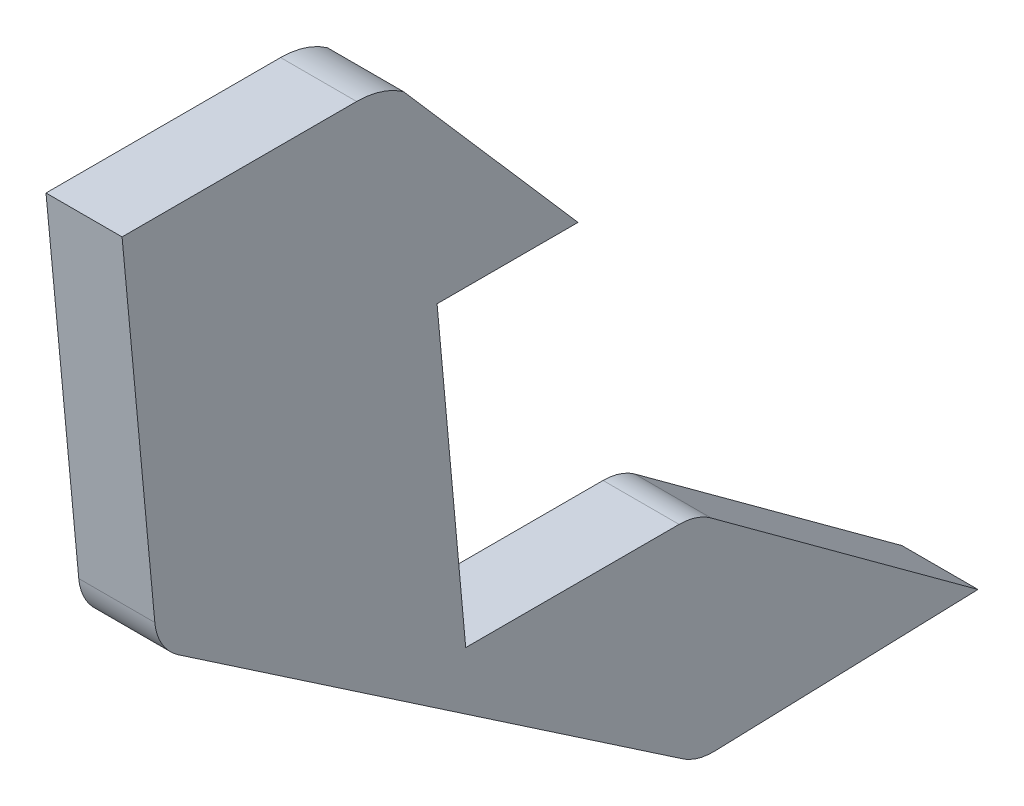
ISO-10303-21;
HEADER;
FILE_DESCRIPTION(('STEP AP214'),'2;1');
FILE_NAME('part.step','',(''),(''),'','','');
FILE_SCHEMA(('AUTOMOTIVE_DESIGN { 1 0 10303 214 1 1 1 1 }'));
ENDSEC;
DATA;
#1=APPLICATION_CONTEXT('core data for automotive mechanical design processes');
#2=APPLICATION_PROTOCOL_DEFINITION('international standard','automotive_design',2000,#1);
#3=PRODUCT_CONTEXT('',#1,'mechanical');
#4=PRODUCT('Part','Part','',(#3));
#5=PRODUCT_RELATED_PRODUCT_CATEGORY('part','',(#4));
#6=PRODUCT_DEFINITION_FORMATION('','',#4);
#7=PRODUCT_DEFINITION_CONTEXT('part definition',#1,'design');
#8=PRODUCT_DEFINITION('design','',#6,#7);
#9=PRODUCT_DEFINITION_SHAPE('','',#8);
#10=(LENGTH_UNIT() NAMED_UNIT(*) SI_UNIT(.MILLI.,.METRE.));
#11=(NAMED_UNIT(*) PLANE_ANGLE_UNIT() SI_UNIT($,.RADIAN.));
#12=(NAMED_UNIT(*) SI_UNIT($,.STERADIAN.) SOLID_ANGLE_UNIT());
#13=UNCERTAINTY_MEASURE_WITH_UNIT(LENGTH_MEASURE(1.E-05),#10,'distance_accuracy_value','');
#14=(GEOMETRIC_REPRESENTATION_CONTEXT(3) GLOBAL_UNCERTAINTY_ASSIGNED_CONTEXT((#13)) GLOBAL_UNIT_ASSIGNED_CONTEXT((#10,
#11,#12)) REPRESENTATION_CONTEXT('',''));
#15=CARTESIAN_POINT('',(0.,0.,0.));
#16=DIRECTION('',(0.,0.,1.));
#17=DIRECTION('',(1.,0.,0.));
#18=AXIS2_PLACEMENT_3D('',#15,#16,#17);
#19=CARTESIAN_POINT('',(4.55229940712901,-38.6706930550426,-6.72531433133768));
#20=DIRECTION('',(-1.,0.,0.));
#21=DIRECTION('',(0.,0.,1.));
#22=AXIS2_PLACEMENT_3D('',#19,#20,#21);
#23=PLANE('',#22);
#24=CARTESIAN_POINT('',(4.55229940712886,-37.5737940115763,-7.17433339564121));
#25=CARTESIAN_POINT('',(4.55229940712886,-37.5737940115762,-7.2081611509258));
#26=CARTESIAN_POINT('',(4.55229940712886,-37.5932955104338,-7.23580185587164));
#27=(BOUNDED_CURVE() B_SPLINE_CURVE(2,(#24,#25,#26),.UNSPECIFIED.,.F.,
.F.) B_SPLINE_CURVE_WITH_KNOTS((3,3),(6.5165136290714,6.60867834182876),
.UNSPECIFIED.) CURVE() GEOMETRIC_REPRESENTATION_ITEM() RATIONAL_B_SPLINE_CURVE((1.,
0.953179249372349,1.)) REPRESENTATION_ITEM(''));
#28=CARTESIAN_POINT('',(4.55229940712886,-37.5737940115763,-7.17433339564121));
#29=VERTEX_POINT('',#28);
#30=CARTESIAN_POINT('',(4.55229940712886,-37.5932955104338,-7.23580185587164));
#31=VERTEX_POINT('',#30);
#32=EDGE_CURVE('E203',#29,#31,#27,.T.);
#33=ORIENTED_EDGE('',*,*,#32,.T.);
#34=CARTESIAN_POINT('',(4.55229940712886,-37.5932955104338,-7.23580185587164));
#35=CARTESIAN_POINT('',(4.5522994071289,-37.8570033272392,-7.46541150862747));
#36=(BOUNDED_CURVE() B_SPLINE_CURVE(1,(#34,#35),.UNSPECIFIED.,.F.,
.F.) B_SPLINE_CURVE_WITH_KNOTS((2,2),(6.60867834182876,7.10058217206499),
.UNSPECIFIED.) CURVE() GEOMETRIC_REPRESENTATION_ITEM() RATIONAL_B_SPLINE_CURVE((1.,1.)) REPRESENTATION_ITEM(''));
#37=CARTESIAN_POINT('',(4.5522994071289,-37.8570033272392,-7.46541150862747));
#38=VERTEX_POINT('',#37);
#39=EDGE_CURVE('E256',#31,#38,#36,.T.);
#40=ORIENTED_EDGE('',*,*,#39,.T.);
#41=CARTESIAN_POINT('',(4.5522994071289,-37.8570033272392,-7.46541150862747));
#42=CARTESIAN_POINT('',(4.5522994071289,-37.8570033272392,-7.28004364208453));
#43=(BOUNDED_CURVE() B_SPLINE_CURVE(1,(#41,#42),.UNSPECIFIED.,.F.,
.F.) B_SPLINE_CURVE_WITH_KNOTS((2,2),(7.10058217206499,7.36135851346102),
.UNSPECIFIED.) CURVE() GEOMETRIC_REPRESENTATION_ITEM() RATIONAL_B_SPLINE_CURVE((1.,1.)) REPRESENTATION_ITEM(''));
#44=CARTESIAN_POINT('',(4.5522994071289,-37.8570033272392,-7.28004364208453));
#45=VERTEX_POINT('',#44);
#46=EDGE_CURVE('E279',#38,#45,#43,.T.);
#47=ORIENTED_EDGE('',*,*,#46,.T.);
#48=CARTESIAN_POINT('',(4.5522994071289,-37.8570033272392,-7.28004364208453));
#49=CARTESIAN_POINT('',(4.55229940712896,-38.2672151966612,-7.31769378490215));
#50=(BOUNDED_CURVE() B_SPLINE_CURVE(1,(#48,#49),.UNSPECIFIED.,.F.,
.F.) B_SPLINE_CURVE_WITH_KNOTS((2,2),(7.36135851346102,7.94087198887989),
.UNSPECIFIED.) CURVE() GEOMETRIC_REPRESENTATION_ITEM() RATIONAL_B_SPLINE_CURVE((1.,1.)) REPRESENTATION_ITEM(''));
#51=CARTESIAN_POINT('',(4.55229940712896,-38.2672151966612,-7.31769378490215));
#52=VERTEX_POINT('',#51);
#53=EDGE_CURVE('E375',#45,#52,#50,.T.);
#54=ORIENTED_EDGE('',*,*,#53,.T.);
#55=CARTESIAN_POINT('',(4.55229940712896,-38.2672151966612,-7.31769378490215));
#56=CARTESIAN_POINT('',(4.55229940712896,-38.2672151966612,-7.59824869309046));
#57=(BOUNDED_CURVE() B_SPLINE_CURVE(1,(#55,#56),.UNSPECIFIED.,.F.,
.F.) B_SPLINE_CURVE_WITH_KNOTS((2,2),(7.94087198887989,8.33555788499823),
.UNSPECIFIED.) CURVE() GEOMETRIC_REPRESENTATION_ITEM() RATIONAL_B_SPLINE_CURVE((1.,1.)) REPRESENTATION_ITEM(''));
#58=CARTESIAN_POINT('',(4.55229940712896,-38.2672151966612,-7.59824869309046));
#59=VERTEX_POINT('',#58);
#60=EDGE_CURVE('E319',#52,#59,#57,.T.);
#61=ORIENTED_EDGE('',*,*,#60,.T.);
#62=CARTESIAN_POINT('',(4.55229940712896,-38.2672151966612,-7.59824869309046));
#63=CARTESIAN_POINT('',(4.55229940712896,-38.2672151966612,-7.62148295572081));
#64=CARTESIAN_POINT('',(4.55229940712897,-38.2809378314921,-7.64023182910751));
#65=(BOUNDED_CURVE() B_SPLINE_CURVE(2,(#62,#63,#64),.UNSPECIFIED.,.F.,
.F.) B_SPLINE_CURVE_WITH_KNOTS((3,3),(8.33555788499823,8.39874065809144),
.UNSPECIFIED.) CURVE() GEOMETRIC_REPRESENTATION_ITEM() RATIONAL_B_SPLINE_CURVE((1.,
0.950512851350493,1.)) REPRESENTATION_ITEM(''));
#66=CARTESIAN_POINT('',(4.55229940712897,-38.2809378314921,-7.64023182910751));
#67=VERTEX_POINT('',#66);
#68=EDGE_CURVE('E193',#59,#67,#65,.T.);
#69=ORIENTED_EDGE('',*,*,#68,.T.);
#70=CARTESIAN_POINT('',(4.55229940712897,-38.2809378314921,-7.64023182910751));
#71=CARTESIAN_POINT('',(4.55229940712901,-38.537792255225,-7.99116524158264));
#72=(BOUNDED_CURVE() B_SPLINE_CURVE(1,(#70,#71),.UNSPECIFIED.,.F.,
.F.) B_SPLINE_CURVE_WITH_KNOTS((2,2),(8.39874065809144,9.01054446338169),
.UNSPECIFIED.) CURVE() GEOMETRIC_REPRESENTATION_ITEM() RATIONAL_B_SPLINE_CURVE((1.,1.)) REPRESENTATION_ITEM(''));
#73=CARTESIAN_POINT('',(4.55229940712901,-38.537792255225,-7.99116524158264));
#74=VERTEX_POINT('',#73);
#75=EDGE_CURVE('E182',#67,#74,#72,.T.);
#76=ORIENTED_EDGE('',*,*,#75,.T.);
#77=CARTESIAN_POINT('',(4.55229940712901,-38.537792255225,-7.99116524158264));
#78=CARTESIAN_POINT('',(4.552299407129,-38.548779565514,-7.64519042674114));
#79=(BOUNDED_CURVE() B_SPLINE_CURVE(1,(#77,#78),.UNSPECIFIED.,.F.,
.F.) B_SPLINE_CURVE_WITH_KNOTS((2,2),(9.01054446338169,9.49750875223138),
.UNSPECIFIED.) CURVE() GEOMETRIC_REPRESENTATION_ITEM() RATIONAL_B_SPLINE_CURVE((1.,1.)) REPRESENTATION_ITEM(''));
#80=CARTESIAN_POINT('',(4.552299407129,-38.548779565514,-7.64519042674114));
#81=VERTEX_POINT('',#80);
#82=EDGE_CURVE('E165',#74,#81,#79,.T.);
#83=ORIENTED_EDGE('',*,*,#82,.T.);
#84=CARTESIAN_POINT('',(4.552299407129,-38.548779565514,-7.64519042674114));
#85=CARTESIAN_POINT('',(4.552299407129,-38.5495122781504,-7.62211834521965));
#86=CARTESIAN_POINT('',(4.552299407129,-38.5365497410859,-7.60301780998124));
#87=(BOUNDED_CURVE() B_SPLINE_CURVE(2,(#84,#85,#86),.UNSPECIFIED.,.F.,
.F.) B_SPLINE_CURVE_WITH_KNOTS((3,3),(9.49750875223138,9.56030858586905),
.UNSPECIFIED.) CURVE() GEOMETRIC_REPRESENTATION_ITEM() RATIONAL_B_SPLINE_CURVE((1.,
0.95110597685321,1.)) REPRESENTATION_ITEM(''));
#88=CARTESIAN_POINT('',(4.552299407129,-38.5365497410859,-7.60301780998124));
#89=VERTEX_POINT('',#88);
#90=EDGE_CURVE('E149',#81,#89,#87,.T.);
#91=ORIENTED_EDGE('',*,*,#90,.T.);
#92=CARTESIAN_POINT('',(4.552299407129,-38.5365497410859,-7.60301780998124));
#93=CARTESIAN_POINT('',(4.55229940712893,-38.0865190359796,-6.93988934227017));
#94=(BOUNDED_CURVE() B_SPLINE_CURVE(1,(#92,#93),.UNSPECIFIED.,.F.,
.F.) B_SPLINE_CURVE_WITH_KNOTS((2,2),(9.56030858586905,10.6877436581383),
.UNSPECIFIED.) CURVE() GEOMETRIC_REPRESENTATION_ITEM() RATIONAL_B_SPLINE_CURVE((1.,1.)) REPRESENTATION_ITEM(''));
#95=CARTESIAN_POINT('',(4.55229940712893,-38.0865190359796,-6.93988934227017));
#96=VERTEX_POINT('',#95);
#97=EDGE_CURVE('E155',#89,#96,#94,.T.);
#98=ORIENTED_EDGE('',*,*,#97,.T.);
#99=CARTESIAN_POINT('',(4.55229940712893,-38.0865190359796,-6.93988934227017));
#100=CARTESIAN_POINT('',(4.55229940712893,-38.0676955186332,-6.91215254548445));
#101=CARTESIAN_POINT('',(4.55229940712892,-38.0343201821641,-6.90903138915979));
#102=(BOUNDED_CURVE() B_SPLINE_CURVE(2,(#99,#100,#101),.UNSPECIFIED.,.F.,
.F.) B_SPLINE_CURVE_WITH_KNOTS((3,3),(10.6877436581383,10.7758735788468),
.UNSPECIFIED.) CURVE() GEOMETRIC_REPRESENTATION_ITEM() RATIONAL_B_SPLINE_CURVE((1.,
0.904474780558574,1.)) REPRESENTATION_ITEM(''));
#103=CARTESIAN_POINT('',(4.55229940712892,-38.0343201821641,-6.90903138915979));
#104=VERTEX_POINT('',#103);
#105=EDGE_CURVE('E221',#96,#104,#102,.T.);
#106=ORIENTED_EDGE('',*,*,#105,.T.);
#107=CARTESIAN_POINT('',(4.55229940712892,-38.0343201821641,-6.90903138915979));
#108=CARTESIAN_POINT('',(4.55229940712886,-37.5737940115763,-6.8659644324761));
#109=(BOUNDED_CURVE() B_SPLINE_CURVE(1,(#107,#108),.UNSPECIFIED.,.F.,
.F.) B_SPLINE_CURVE_WITH_KNOTS((2,2),(10.7758735788468,11.4265706254297),
.UNSPECIFIED.) CURVE() GEOMETRIC_REPRESENTATION_ITEM() RATIONAL_B_SPLINE_CURVE((1.,1.)) REPRESENTATION_ITEM(''));
#110=CARTESIAN_POINT('',(4.55229940712886,-37.5737940115763,-6.8659644324761));
#111=VERTEX_POINT('',#110);
#112=EDGE_CURVE('E212',#104,#111,#109,.T.);
#113=ORIENTED_EDGE('',*,*,#112,.T.);
#114=CARTESIAN_POINT('',(4.55229940712886,-37.5737940115763,-6.8659644324761));
#115=CARTESIAN_POINT('',(4.55229940712886,-37.5737940115763,-7.17433339564121));
#116=(BOUNDED_CURVE() B_SPLINE_CURVE(1,(#114,#115),.UNSPECIFIED.,.F.,
.F.) B_SPLINE_CURVE_WITH_KNOTS((2,2),(11.4265706254297,11.8603854581406),
.UNSPECIFIED.) CURVE() GEOMETRIC_REPRESENTATION_ITEM() RATIONAL_B_SPLINE_CURVE((1.,1.)) REPRESENTATION_ITEM(''));
#117=EDGE_CURVE('E11',#111,#29,#116,.T.);
#118=ORIENTED_EDGE('',*,*,#117,.T.);
#119=EDGE_LOOP('',(#33,#40,#47,#54,#61,#69,#76,#83,#91,#98,#106,#113,#118));
#120=FACE_BOUND('',#119,.T.);
#121=ADVANCED_FACE('F16',(#120),#23,.T.);
#122=CARTESIAN_POINT('',(4.65229940712901,-38.6706930550426,-6.72531433133768));
#123=DIRECTION('',(1.,0.,0.));
#124=DIRECTION('',(0.,1.,0.));
#125=AXIS2_PLACEMENT_3D('',#122,#123,#124);
#126=PLANE('',#125);
#127=CARTESIAN_POINT('',(4.65229940712886,-37.5737940115763,-6.8659644324761));
#128=CARTESIAN_POINT('',(4.65229940712886,-37.5737940115763,-7.17433339564121));
#129=(BOUNDED_CURVE() B_SPLINE_CURVE(1,(#127,#128),.UNSPECIFIED.,.F.,
.F.) B_SPLINE_CURVE_WITH_KNOTS((2,2),(11.4265706254297,11.8603854581406),
.UNSPECIFIED.) CURVE() GEOMETRIC_REPRESENTATION_ITEM() RATIONAL_B_SPLINE_CURVE((1.,1.)) REPRESENTATION_ITEM(''));
#130=CARTESIAN_POINT('',(4.65229940712886,-37.5737940115763,-6.8659644324761));
#131=VERTEX_POINT('',#130);
#132=CARTESIAN_POINT('',(4.65229940712886,-37.5737940115763,-7.17433339564121));
#133=VERTEX_POINT('',#132);
#134=EDGE_CURVE('E28',#131,#133,#129,.T.);
#135=ORIENTED_EDGE('',*,*,#134,.F.);
#136=CARTESIAN_POINT('',(4.65229940712892,-38.0343201821641,-6.90903138915979));
#137=CARTESIAN_POINT('',(4.65229940712886,-37.5737940115763,-6.8659644324761));
#138=(BOUNDED_CURVE() B_SPLINE_CURVE(1,(#136,#137),.UNSPECIFIED.,.F.,
.F.) B_SPLINE_CURVE_WITH_KNOTS((2,2),(10.7758735788468,11.4265706254297),
.UNSPECIFIED.) CURVE() GEOMETRIC_REPRESENTATION_ITEM() RATIONAL_B_SPLINE_CURVE((1.,1.)) REPRESENTATION_ITEM(''));
#139=CARTESIAN_POINT('',(4.65229940712892,-38.0343201821641,-6.90903138915979));
#140=VERTEX_POINT('',#139);
#141=EDGE_CURVE('E230',#140,#131,#138,.T.);
#142=ORIENTED_EDGE('',*,*,#141,.F.);
#143=CARTESIAN_POINT('',(4.65229940712893,-38.0865190359796,-6.93988934227017));
#144=CARTESIAN_POINT('',(4.65229940712893,-38.0676955186332,-6.91215254548445));
#145=CARTESIAN_POINT('',(4.65229940712892,-38.0343201821641,-6.90903138915979));
#146=(BOUNDED_CURVE() B_SPLINE_CURVE(2,(#143,#144,#145),.UNSPECIFIED.,.F.,
.F.) B_SPLINE_CURVE_WITH_KNOTS((3,3),(10.6877436581383,10.7758735788468),
.UNSPECIFIED.) CURVE() GEOMETRIC_REPRESENTATION_ITEM() RATIONAL_B_SPLINE_CURVE((1.,
0.904474780558574,1.)) REPRESENTATION_ITEM(''));
#147=CARTESIAN_POINT('',(4.65229940712893,-38.0865190359796,-6.93988934227017));
#148=VERTEX_POINT('',#147);
#149=EDGE_CURVE('E143',#148,#140,#146,.T.);
#150=ORIENTED_EDGE('',*,*,#149,.F.);
#151=CARTESIAN_POINT('',(4.652299407129,-38.5365497410859,-7.60301780998124));
#152=CARTESIAN_POINT('',(4.65229940712893,-38.0865190359796,-6.93988934227017));
#153=(BOUNDED_CURVE() B_SPLINE_CURVE(1,(#151,#152),.UNSPECIFIED.,.F.,
.F.) B_SPLINE_CURVE_WITH_KNOTS((2,2),(9.56030858586905,10.6877436581383),
.UNSPECIFIED.) CURVE() GEOMETRIC_REPRESENTATION_ITEM() RATIONAL_B_SPLINE_CURVE((1.,1.)) REPRESENTATION_ITEM(''));
#154=CARTESIAN_POINT('',(4.652299407129,-38.5365497410859,-7.60301780998124));
#155=VERTEX_POINT('',#154);
#156=EDGE_CURVE('E135',#155,#148,#153,.T.);
#157=ORIENTED_EDGE('',*,*,#156,.F.);
#158=CARTESIAN_POINT('',(4.65229940712901,-38.548779565514,-7.64519042674114));
#159=CARTESIAN_POINT('',(4.65229940712901,-38.5495122781504,-7.62211834521965));
#160=CARTESIAN_POINT('',(4.652299407129,-38.5365497410859,-7.60301780998124));
#161=(BOUNDED_CURVE() B_SPLINE_CURVE(2,(#158,#159,#160),.UNSPECIFIED.,.F.,
.F.) B_SPLINE_CURVE_WITH_KNOTS((3,3),(9.49750875223138,9.56030858586905),
.UNSPECIFIED.) CURVE() GEOMETRIC_REPRESENTATION_ITEM() RATIONAL_B_SPLINE_CURVE((1.,
0.95110597685321,1.)) REPRESENTATION_ITEM(''));
#162=CARTESIAN_POINT('',(4.65229940712901,-38.548779565514,-7.64519042674114));
#163=VERTEX_POINT('',#162);
#164=EDGE_CURVE('E140',#163,#155,#161,.T.);
#165=ORIENTED_EDGE('',*,*,#164,.F.);
#166=CARTESIAN_POINT('',(4.65229940712901,-38.537792255225,-7.99116524158264));
#167=CARTESIAN_POINT('',(4.65229940712901,-38.548779565514,-7.64519042674114));
#168=(BOUNDED_CURVE() B_SPLINE_CURVE(1,(#166,#167),.UNSPECIFIED.,.F.,
.F.) B_SPLINE_CURVE_WITH_KNOTS((2,2),(9.01054446338169,9.49750875223138),
.UNSPECIFIED.) CURVE() GEOMETRIC_REPRESENTATION_ITEM() RATIONAL_B_SPLINE_CURVE((1.,1.)) REPRESENTATION_ITEM(''));
#169=CARTESIAN_POINT('',(4.65229940712901,-38.537792255225,-7.99116524158264));
#170=VERTEX_POINT('',#169);
#171=EDGE_CURVE('E175',#170,#163,#168,.T.);
#172=ORIENTED_EDGE('',*,*,#171,.F.);
#173=CARTESIAN_POINT('',(4.65229940712897,-38.2809378314921,-7.64023182910751));
#174=CARTESIAN_POINT('',(4.65229940712901,-38.537792255225,-7.99116524158264));
#175=(BOUNDED_CURVE() B_SPLINE_CURVE(1,(#173,#174),.UNSPECIFIED.,.F.,
.F.) B_SPLINE_CURVE_WITH_KNOTS((2,2),(8.39874065809144,9.01054446338169),
.UNSPECIFIED.) CURVE() GEOMETRIC_REPRESENTATION_ITEM() RATIONAL_B_SPLINE_CURVE((1.,1.)) REPRESENTATION_ITEM(''));
#176=CARTESIAN_POINT('',(4.65229940712897,-38.2809378314921,-7.64023182910751));
#177=VERTEX_POINT('',#176);
#178=EDGE_CURVE('E183',#177,#170,#175,.T.);
#179=ORIENTED_EDGE('',*,*,#178,.F.);
#180=CARTESIAN_POINT('',(4.65229940712897,-38.2672151966611,-7.59824869309046));
#181=CARTESIAN_POINT('',(4.65229940712897,-38.2672151966611,-7.62148295572081));
#182=CARTESIAN_POINT('',(4.65229940712897,-38.2809378314921,-7.64023182910751));
#183=(BOUNDED_CURVE() B_SPLINE_CURVE(2,(#180,#181,#182),.UNSPECIFIED.,.F.,
.F.) B_SPLINE_CURVE_WITH_KNOTS((3,3),(8.33555788499823,8.39874065809144),
.UNSPECIFIED.) CURVE() GEOMETRIC_REPRESENTATION_ITEM() RATIONAL_B_SPLINE_CURVE((1.,
0.950512851350493,1.)) REPRESENTATION_ITEM(''));
#184=CARTESIAN_POINT('',(4.65229940712897,-38.2672151966611,-7.59824869309046));
#185=VERTEX_POINT('',#184);
#186=EDGE_CURVE('E305',#185,#177,#183,.T.);
#187=ORIENTED_EDGE('',*,*,#186,.F.);
#188=CARTESIAN_POINT('',(4.65229940712896,-38.2672151966611,-7.31769378490216));
#189=CARTESIAN_POINT('',(4.65229940712897,-38.2672151966611,-7.59824869309046));
#190=(BOUNDED_CURVE() B_SPLINE_CURVE(1,(#188,#189),.UNSPECIFIED.,.F.,
.F.) B_SPLINE_CURVE_WITH_KNOTS((2,2),(7.94087198887989,8.33555788499823),
.UNSPECIFIED.) CURVE() GEOMETRIC_REPRESENTATION_ITEM() RATIONAL_B_SPLINE_CURVE((1.,1.)) REPRESENTATION_ITEM(''));
#191=CARTESIAN_POINT('',(4.65229940712896,-38.2672151966611,-7.31769378490216));
#192=VERTEX_POINT('',#191);
#193=EDGE_CURVE('E383',#192,#185,#190,.T.);
#194=ORIENTED_EDGE('',*,*,#193,.F.);
#195=CARTESIAN_POINT('',(4.6522994071289,-37.8570033272392,-7.28004364208453));
#196=CARTESIAN_POINT('',(4.65229940712896,-38.2672151966611,-7.31769378490216));
#197=(BOUNDED_CURVE() B_SPLINE_CURVE(1,(#195,#196),.UNSPECIFIED.,.F.,
.F.) B_SPLINE_CURVE_WITH_KNOTS((2,2),(7.36135851346102,7.94087198887989),
.UNSPECIFIED.) CURVE() GEOMETRIC_REPRESENTATION_ITEM() RATIONAL_B_SPLINE_CURVE((1.,1.)) REPRESENTATION_ITEM(''));
#198=CARTESIAN_POINT('',(4.6522994071289,-37.8570033272392,-7.28004364208453));
#199=VERTEX_POINT('',#198);
#200=EDGE_CURVE('E270',#199,#192,#197,.T.);
#201=ORIENTED_EDGE('',*,*,#200,.F.);
#202=CARTESIAN_POINT('',(4.65229940712891,-37.8570033272392,-7.46541150862747));
#203=CARTESIAN_POINT('',(4.6522994071289,-37.8570033272392,-7.28004364208453));
#204=(BOUNDED_CURVE() B_SPLINE_CURVE(1,(#202,#203),.UNSPECIFIED.,.F.,
.F.) B_SPLINE_CURVE_WITH_KNOTS((2,2),(7.10058217206499,7.36135851346102),
.UNSPECIFIED.) CURVE() GEOMETRIC_REPRESENTATION_ITEM() RATIONAL_B_SPLINE_CURVE((1.,1.)) REPRESENTATION_ITEM(''));
#205=CARTESIAN_POINT('',(4.65229940712891,-37.8570033272392,-7.46541150862747));
#206=VERTEX_POINT('',#205);
#207=EDGE_CURVE('E247',#206,#199,#204,.T.);
#208=ORIENTED_EDGE('',*,*,#207,.F.);
#209=CARTESIAN_POINT('',(4.65229940712887,-37.5932955104337,-7.23580185587164));
#210=CARTESIAN_POINT('',(4.65229940712891,-37.8570033272392,-7.46541150862747));
#211=(BOUNDED_CURVE() B_SPLINE_CURVE(1,(#209,#210),.UNSPECIFIED.,.F.,
.F.) B_SPLINE_CURVE_WITH_KNOTS((2,2),(6.60867834182876,7.10058217206499),
.UNSPECIFIED.) CURVE() GEOMETRIC_REPRESENTATION_ITEM() RATIONAL_B_SPLINE_CURVE((1.,1.)) REPRESENTATION_ITEM(''));
#212=CARTESIAN_POINT('',(4.65229940712887,-37.5932955104337,-7.23580185587164));
#213=VERTEX_POINT('',#212);
#214=EDGE_CURVE('E286',#213,#206,#211,.T.);
#215=ORIENTED_EDGE('',*,*,#214,.F.);
#216=CARTESIAN_POINT('',(4.65229940712886,-37.5737940115763,-7.17433339564121));
#217=CARTESIAN_POINT('',(4.65229940712886,-37.5737940115762,-7.2081611509258));
#218=CARTESIAN_POINT('',(4.65229940712887,-37.5932955104337,-7.23580185587164));
#219=(BOUNDED_CURVE() B_SPLINE_CURVE(2,(#216,#217,#218),.UNSPECIFIED.,.F.,
.F.) B_SPLINE_CURVE_WITH_KNOTS((3,3),(6.5165136290714,6.60867834182876),
.UNSPECIFIED.) CURVE() GEOMETRIC_REPRESENTATION_ITEM() RATIONAL_B_SPLINE_CURVE((1.,
0.953179249372349,1.)) REPRESENTATION_ITEM(''));
#220=EDGE_CURVE('E204',#133,#213,#219,.T.);
#221=ORIENTED_EDGE('',*,*,#220,.F.);
#222=EDGE_LOOP('',(#135,#142,#150,#157,#165,#172,#179,#187,#194,#201,#208,#215,#221));
#223=FACE_BOUND('',#222,.T.);
#224=ADVANCED_FACE('F137',(#223),#126,.T.);
#225=CARTESIAN_POINT('',(4.65229940712886,-37.5737940115763,-6.8659644324761));
#226=DIRECTION('',(0.,1.,0.));
#227=DIRECTION('',(1.,0.,0.));
#228=AXIS2_PLACEMENT_3D('',#225,#226,#227);
#229=PLANE('',#228);
#230=ORIENTED_EDGE('',*,*,#134,.T.);
#231=CARTESIAN_POINT('',(4.65229940712886,-37.5737940115763,-7.17433339564121));
#232=CARTESIAN_POINT('',(4.55229940712886,-37.5737940115763,-7.17433339564121));
#233=(BOUNDED_CURVE() B_SPLINE_CURVE(1,(#231,#232),.UNSPECIFIED.,.F.,
.F.) B_SPLINE_CURVE_WITH_KNOTS((2,2),(0.,0.1),
.UNSPECIFIED.) CURVE() GEOMETRIC_REPRESENTATION_ITEM() RATIONAL_B_SPLINE_CURVE((1.,1.)) REPRESENTATION_ITEM(''));
#234=EDGE_CURVE('E296',#133,#29,#233,.T.);
#235=ORIENTED_EDGE('',*,*,#234,.T.);
#236=ORIENTED_EDGE('',*,*,#117,.F.);
#237=CARTESIAN_POINT('',(4.65229940712886,-37.5737940115763,-6.8659644324761));
#238=CARTESIAN_POINT('',(4.55229940712886,-37.5737940115763,-6.8659644324761));
#239=(BOUNDED_CURVE() B_SPLINE_CURVE(1,(#237,#238),.UNSPECIFIED.,.F.,
.F.) B_SPLINE_CURVE_WITH_KNOTS((2,2),(0.,0.1),
.UNSPECIFIED.) CURVE() GEOMETRIC_REPRESENTATION_ITEM() RATIONAL_B_SPLINE_CURVE((1.,1.)) REPRESENTATION_ITEM(''));
#240=EDGE_CURVE('E220',#131,#111,#239,.T.);
#241=ORIENTED_EDGE('',*,*,#240,.F.);
#242=EDGE_LOOP('',(#230,#235,#236,#241));
#243=FACE_BOUND('',#242,.T.);
#244=ADVANCED_FACE('F505',(#243),#229,.T.);
#245=CARTESIAN_POINT('',(4.65229940712892,-38.0343201821641,-6.90903138915979));
#246=DIRECTION('',(0.,-0.0931105912652095,0.995655772741887));
#247=DIRECTION('',(-1.,-2.94068913212695E-13,0.));
#248=AXIS2_PLACEMENT_3D('',#245,#246,#247);
#249=PLANE('',#248);
#250=ORIENTED_EDGE('',*,*,#141,.T.);
#251=ORIENTED_EDGE('',*,*,#240,.T.);
#252=ORIENTED_EDGE('',*,*,#112,.F.);
#253=CARTESIAN_POINT('',(4.65229940712892,-38.0343201821641,-6.90903138915979));
#254=CARTESIAN_POINT('',(4.55229940712892,-38.0343201821641,-6.90903138915979));
#255=(BOUNDED_CURVE() B_SPLINE_CURVE(1,(#253,#254),.UNSPECIFIED.,.F.,
.F.) B_SPLINE_CURVE_WITH_KNOTS((2,2),(0.,0.1),
.UNSPECIFIED.) CURVE() GEOMETRIC_REPRESENTATION_ITEM() RATIONAL_B_SPLINE_CURVE((1.,1.)) REPRESENTATION_ITEM(''));
#256=EDGE_CURVE('E19',#140,#104,#255,.T.);
#257=ORIENTED_EDGE('',*,*,#256,.F.);
#258=EDGE_LOOP('',(#250,#251,#252,#257));
#259=FACE_BOUND('',#258,.T.);
#260=ADVANCED_FACE('F508',(#259),#249,.T.);
#261=CARTESIAN_POINT('',(4.65229940712893,-38.0865190359796,-6.93988934227017));
#262=CARTESIAN_POINT('',(4.55229940712893,-38.0865190359796,-6.93988934227017));
#263=CARTESIAN_POINT('',(4.65229940712893,-38.0676955186332,-6.91215254548445));
#264=CARTESIAN_POINT('',(4.55229940712893,-38.0676955186332,-6.91215254548445));
#265=CARTESIAN_POINT('',(4.65229940712892,-38.0343201821641,-6.90903138915979));
#266=CARTESIAN_POINT('',(4.55229940712892,-38.0343201821641,-6.90903138915979));
#267=(BOUNDED_SURFACE() B_SPLINE_SURFACE(2,1,((#261,#262),(#263,#264),(#265,#266)),
.UNSPECIFIED.,.F.,.F.,.F.) B_SPLINE_SURFACE_WITH_KNOTS((3,3),(2,2),(10.6877436581383,
10.7758735788468),(0.,0.1),
.UNSPECIFIED.) GEOMETRIC_REPRESENTATION_ITEM() RATIONAL_B_SPLINE_SURFACE(((1.,1.),
(0.904474780558574,0.904474780558574),(1.,1.))) REPRESENTATION_ITEM('') SURFACE());
#268=CARTESIAN_POINT('',(4.65229940712893,-38.0865190359796,-6.93988934227017));
#269=CARTESIAN_POINT('',(4.55229940712893,-38.0865190359796,-6.93988934227017));
#270=(BOUNDED_CURVE() B_SPLINE_CURVE(1,(#268,#269),.UNSPECIFIED.,.F.,
.F.) B_SPLINE_CURVE_WITH_KNOTS((2,2),(0.,0.1),
.UNSPECIFIED.) CURVE() GEOMETRIC_REPRESENTATION_ITEM() RATIONAL_B_SPLINE_CURVE((1.,1.)) REPRESENTATION_ITEM(''));
#271=EDGE_CURVE('E148',#148,#96,#270,.T.);
#272=ORIENTED_EDGE('',*,*,#149,.T.);
#273=ORIENTED_EDGE('',*,*,#256,.T.);
#274=ORIENTED_EDGE('',*,*,#105,.F.);
#275=ORIENTED_EDGE('',*,*,#271,.F.);
#276=EDGE_LOOP('',(#272,#273,#274,#275));
#277=FACE_BOUND('',#276,.T.);
#278=ADVANCED_FACE('F511',(#277),#267,.T.);
#279=CARTESIAN_POINT('',(4.652299407129,-38.5365497410859,-7.60301780998124));
#280=DIRECTION('',(1.53074691496176E-13,-0.827446394816256,0.561544712116124));
#281=DIRECTION('',(-1.,-1.84996505459629E-13,0.));
#282=AXIS2_PLACEMENT_3D('',#279,#280,#281);
#283=PLANE('',#282);
#284=ORIENTED_EDGE('',*,*,#156,.T.);
#285=ORIENTED_EDGE('',*,*,#271,.T.);
#286=ORIENTED_EDGE('',*,*,#97,.F.);
#287=CARTESIAN_POINT('',(4.652299407129,-38.5365497410859,-7.60301780998124));
#288=CARTESIAN_POINT('',(4.552299407129,-38.5365497410859,-7.60301780998124));
#289=(BOUNDED_CURVE() B_SPLINE_CURVE(1,(#287,#288),.UNSPECIFIED.,.F.,
.F.) B_SPLINE_CURVE_WITH_KNOTS((2,2),(0.,0.1),
.UNSPECIFIED.) CURVE() GEOMETRIC_REPRESENTATION_ITEM() RATIONAL_B_SPLINE_CURVE((1.,1.)) REPRESENTATION_ITEM(''));
#290=EDGE_CURVE('E152',#155,#89,#289,.T.);
#291=ORIENTED_EDGE('',*,*,#290,.F.);
#292=EDGE_LOOP('',(#284,#285,#286,#291));
#293=FACE_BOUND('',#292,.T.);
#294=ADVANCED_FACE('F153',(#293),#283,.T.);
#295=CARTESIAN_POINT('',(4.65229940712901,-38.548779565514,-7.64519042674114));
#296=CARTESIAN_POINT('',(4.552299407129,-38.548779565514,-7.64519042674114));
#297=CARTESIAN_POINT('',(4.65229940712901,-38.5495122781504,-7.62211834521965));
#298=CARTESIAN_POINT('',(4.552299407129,-38.5495122781504,-7.62211834521965));
#299=CARTESIAN_POINT('',(4.652299407129,-38.5365497410859,-7.60301780998124));
#300=CARTESIAN_POINT('',(4.552299407129,-38.5365497410859,-7.60301780998124));
#301=(BOUNDED_SURFACE() B_SPLINE_SURFACE(2,1,((#295,#296),(#297,#298),(#299,#300)),
.UNSPECIFIED.,.F.,.F.,.F.) B_SPLINE_SURFACE_WITH_KNOTS((3,3),(2,2),(9.49750875223138,
9.56030858586905),(0.,0.1),
.UNSPECIFIED.) GEOMETRIC_REPRESENTATION_ITEM() RATIONAL_B_SPLINE_SURFACE(((1.,1.),
(0.95110597685321,0.95110597685321),(1.,1.))) REPRESENTATION_ITEM('') SURFACE());
#302=CARTESIAN_POINT('',(4.65229940712901,-38.548779565514,-7.64519042674114));
#303=CARTESIAN_POINT('',(4.552299407129,-38.548779565514,-7.64519042674114));
#304=(BOUNDED_CURVE() B_SPLINE_CURVE(1,(#302,#303),.UNSPECIFIED.,.F.,
.F.) B_SPLINE_CURVE_WITH_KNOTS((2,2),(0.,0.1),
.UNSPECIFIED.) CURVE() GEOMETRIC_REPRESENTATION_ITEM() RATIONAL_B_SPLINE_CURVE((1.,1.)) REPRESENTATION_ITEM(''));
#305=EDGE_CURVE('E162',#163,#81,#304,.T.);
#306=ORIENTED_EDGE('',*,*,#164,.T.);
#307=ORIENTED_EDGE('',*,*,#290,.T.);
#308=ORIENTED_EDGE('',*,*,#90,.F.);
#309=ORIENTED_EDGE('',*,*,#305,.F.);
#310=EDGE_LOOP('',(#306,#307,#308,#309));
#311=FACE_BOUND('',#310,.T.);
#312=ADVANCED_FACE('F160',(#311),#301,.T.);
#313=CARTESIAN_POINT('',(4.65229940712901,-38.537792255225,-7.99116524158264));
#314=DIRECTION('',(1.41585865689375E-13,-0.999496110323458,-0.031741541365826));
#315=DIRECTION('',(0.,0.031741541365826,-0.999496110323458));
#316=AXIS2_PLACEMENT_3D('',#313,#314,#315);
#317=PLANE('',#316);
#318=ORIENTED_EDGE('',*,*,#171,.T.);
#319=ORIENTED_EDGE('',*,*,#305,.T.);
#320=ORIENTED_EDGE('',*,*,#82,.F.);
#321=CARTESIAN_POINT('',(4.65229940712901,-38.537792255225,-7.99116524158264));
#322=CARTESIAN_POINT('',(4.55229940712901,-38.537792255225,-7.99116524158264));
#323=(BOUNDED_CURVE() B_SPLINE_CURVE(1,(#321,#322),.UNSPECIFIED.,.F.,
.F.) B_SPLINE_CURVE_WITH_KNOTS((2,2),(0.,0.1),
.UNSPECIFIED.) CURVE() GEOMETRIC_REPRESENTATION_ITEM() RATIONAL_B_SPLINE_CURVE((1.,1.)) REPRESENTATION_ITEM(''));
#324=EDGE_CURVE('E192',#170,#74,#323,.T.);
#325=ORIENTED_EDGE('',*,*,#324,.F.);
#326=EDGE_LOOP('',(#318,#319,#320,#325));
#327=FACE_BOUND('',#326,.T.);
#328=ADVANCED_FACE('F513',(#327),#317,.T.);
#329=CARTESIAN_POINT('',(4.65229940712897,-38.2809378314921,-7.64023182910751));
#330=DIRECTION('',(-1.00132745036367E-13,0.806949361166113,-0.590620629942438));
#331=DIRECTION('',(-1.,0.,1.69538177232525E-13));
#332=AXIS2_PLACEMENT_3D('',#329,#330,#331);
#333=PLANE('',#332);
#334=ORIENTED_EDGE('',*,*,#178,.T.);
#335=ORIENTED_EDGE('',*,*,#324,.T.);
#336=ORIENTED_EDGE('',*,*,#75,.F.);
#337=CARTESIAN_POINT('',(4.65229940712897,-38.2809378314921,-7.64023182910751));
#338=CARTESIAN_POINT('',(4.55229940712897,-38.2809378314921,-7.64023182910751));
#339=(BOUNDED_CURVE() B_SPLINE_CURVE(1,(#337,#338),.UNSPECIFIED.,.F.,
.F.) B_SPLINE_CURVE_WITH_KNOTS((2,2),(0.,0.1),
.UNSPECIFIED.) CURVE() GEOMETRIC_REPRESENTATION_ITEM() RATIONAL_B_SPLINE_CURVE((1.,1.)) REPRESENTATION_ITEM(''));
#340=EDGE_CURVE('E297',#177,#67,#339,.T.);
#341=ORIENTED_EDGE('',*,*,#340,.F.);
#342=EDGE_LOOP('',(#334,#335,#336,#341));
#343=FACE_BOUND('',#342,.T.);
#344=ADVANCED_FACE('F486',(#343),#333,.T.);
#345=CARTESIAN_POINT('',(4.65229940712897,-38.2672151966611,-7.59824869309046));
#346=CARTESIAN_POINT('',(4.55229940712896,-38.2672151966612,-7.59824869309046));
#347=CARTESIAN_POINT('',(4.65229940712897,-38.2672151966611,-7.62148295572081));
#348=CARTESIAN_POINT('',(4.55229940712896,-38.2672151966612,-7.62148295572081));
#349=CARTESIAN_POINT('',(4.65229940712897,-38.2809378314921,-7.64023182910751));
#350=CARTESIAN_POINT('',(4.55229940712897,-38.2809378314921,-7.64023182910751));
#351=(BOUNDED_SURFACE() B_SPLINE_SURFACE(2,1,((#345,#346),(#347,#348),(#349,#350)),
.UNSPECIFIED.,.F.,.F.,.F.) B_SPLINE_SURFACE_WITH_KNOTS((3,3),(2,2),(8.33555788499823,
8.39874065809144),(0.,0.1),
.UNSPECIFIED.) GEOMETRIC_REPRESENTATION_ITEM() RATIONAL_B_SPLINE_SURFACE(((1.,1.),
(0.950512851350493,0.950512851350493),(1.,1.))) REPRESENTATION_ITEM('') SURFACE());
#352=CARTESIAN_POINT('',(4.65229940712897,-38.2672151966611,-7.59824869309046));
#353=CARTESIAN_POINT('',(4.55229940712896,-38.2672151966612,-7.59824869309046));
#354=(BOUNDED_CURVE() B_SPLINE_CURVE(1,(#352,#353),.UNSPECIFIED.,.F.,
.F.) B_SPLINE_CURVE_WITH_KNOTS((2,2),(0.,0.1),
.UNSPECIFIED.) CURVE() GEOMETRIC_REPRESENTATION_ITEM() RATIONAL_B_SPLINE_CURVE((1.,1.)) REPRESENTATION_ITEM(''));
#355=EDGE_CURVE('E328',#185,#59,#354,.T.);
#356=ORIENTED_EDGE('',*,*,#186,.T.);
#357=ORIENTED_EDGE('',*,*,#340,.T.);
#358=ORIENTED_EDGE('',*,*,#68,.F.);
#359=ORIENTED_EDGE('',*,*,#355,.F.);
#360=EDGE_LOOP('',(#356,#357,#358,#359));
#361=FACE_BOUND('',#360,.T.);
#362=ADVANCED_FACE('F481',(#361),#351,.T.);
#363=CARTESIAN_POINT('',(4.65229940712896,-38.2672151966611,-7.31769378490216));
#364=DIRECTION('',(0.,1.,0.));
#365=DIRECTION('',(1.,0.,0.));
#366=AXIS2_PLACEMENT_3D('',#363,#364,#365);
#367=PLANE('',#366);
#368=ORIENTED_EDGE('',*,*,#193,.T.);
#369=ORIENTED_EDGE('',*,*,#355,.T.);
#370=ORIENTED_EDGE('',*,*,#60,.F.);
#371=CARTESIAN_POINT('',(4.65229940712896,-38.2672151966611,-7.31769378490216));
#372=CARTESIAN_POINT('',(4.55229940712896,-38.2672151966612,-7.31769378490215));
#373=(BOUNDED_CURVE() B_SPLINE_CURVE(1,(#371,#372),.UNSPECIFIED.,.F.,
.F.) B_SPLINE_CURVE_WITH_KNOTS((2,2),(0.,0.1),
.UNSPECIFIED.) CURVE() GEOMETRIC_REPRESENTATION_ITEM() RATIONAL_B_SPLINE_CURVE((1.,1.)) REPRESENTATION_ITEM(''));
#374=EDGE_CURVE('E278',#192,#52,#373,.T.);
#375=ORIENTED_EDGE('',*,*,#374,.F.);
#376=EDGE_LOOP('',(#368,#369,#370,#375));
#377=FACE_BOUND('',#376,.T.);
#378=ADVANCED_FACE('F489',(#377),#367,.T.);
#379=CARTESIAN_POINT('',(4.6522994071289,-37.8570033272392,-7.28004364208453));
#380=DIRECTION('',(0.,0.0913980279711832,-0.995814440788533));
#381=DIRECTION('',(-1.,0.,0.));
#382=AXIS2_PLACEMENT_3D('',#379,#380,#381);
#383=PLANE('',#382);
#384=ORIENTED_EDGE('',*,*,#200,.T.);
#385=ORIENTED_EDGE('',*,*,#374,.T.);
#386=ORIENTED_EDGE('',*,*,#53,.F.);
#387=CARTESIAN_POINT('',(4.6522994071289,-37.8570033272392,-7.28004364208453));
#388=CARTESIAN_POINT('',(4.5522994071289,-37.8570033272392,-7.28004364208453));
#389=(BOUNDED_CURVE() B_SPLINE_CURVE(1,(#387,#388),.UNSPECIFIED.,.F.,
.F.) B_SPLINE_CURVE_WITH_KNOTS((2,2),(0.,0.1),
.UNSPECIFIED.) CURVE() GEOMETRIC_REPRESENTATION_ITEM() RATIONAL_B_SPLINE_CURVE((1.,1.)) REPRESENTATION_ITEM(''));
#390=EDGE_CURVE('E255',#199,#45,#389,.T.);
#391=ORIENTED_EDGE('',*,*,#390,.F.);
#392=EDGE_LOOP('',(#384,#385,#386,#391));
#393=FACE_BOUND('',#392,.T.);
#394=ADVANCED_FACE('F492',(#393),#383,.T.);
#395=CARTESIAN_POINT('',(4.65229940712891,-37.8570033272392,-7.46541150862747));
#396=DIRECTION('',(0.,-1.,0.));
#397=DIRECTION('',(0.,0.,-1.));
#398=AXIS2_PLACEMENT_3D('',#395,#396,#397);
#399=PLANE('',#398);
#400=ORIENTED_EDGE('',*,*,#207,.T.);
#401=ORIENTED_EDGE('',*,*,#390,.T.);
#402=ORIENTED_EDGE('',*,*,#46,.F.);
#403=CARTESIAN_POINT('',(4.65229940712891,-37.8570033272392,-7.46541150862747));
#404=CARTESIAN_POINT('',(4.5522994071289,-37.8570033272392,-7.46541150862747));
#405=(BOUNDED_CURVE() B_SPLINE_CURVE(1,(#403,#404),.UNSPECIFIED.,.F.,
.F.) B_SPLINE_CURVE_WITH_KNOTS((2,2),(0.,0.1),
.UNSPECIFIED.) CURVE() GEOMETRIC_REPRESENTATION_ITEM() RATIONAL_B_SPLINE_CURVE((1.,1.)) REPRESENTATION_ITEM(''));
#406=EDGE_CURVE('E295',#206,#38,#405,.T.);
#407=ORIENTED_EDGE('',*,*,#406,.F.);
#408=EDGE_LOOP('',(#400,#401,#402,#407));
#409=FACE_BOUND('',#408,.T.);
#410=ADVANCED_FACE('F497',(#409),#399,.T.);
#411=CARTESIAN_POINT('',(4.65229940712887,-37.5932955104337,-7.23580185587164));
#412=DIRECTION('',(-1.09394037231049E-13,0.656664704977357,-0.754182647133306));
#413=DIRECTION('',(-1.,0.,1.45049793504083E-13));
#414=AXIS2_PLACEMENT_3D('',#411,#412,#413);
#415=PLANE('',#414);
#416=ORIENTED_EDGE('',*,*,#214,.T.);
#417=ORIENTED_EDGE('',*,*,#406,.T.);
#418=ORIENTED_EDGE('',*,*,#39,.F.);
#419=CARTESIAN_POINT('',(4.65229940712887,-37.5932955104337,-7.23580185587164));
#420=CARTESIAN_POINT('',(4.55229940712886,-37.5932955104338,-7.23580185587164));
#421=(BOUNDED_CURVE() B_SPLINE_CURVE(1,(#419,#420),.UNSPECIFIED.,.F.,
.F.) B_SPLINE_CURVE_WITH_KNOTS((2,2),(0.,0.1),
.UNSPECIFIED.) CURVE() GEOMETRIC_REPRESENTATION_ITEM() RATIONAL_B_SPLINE_CURVE((1.,1.)) REPRESENTATION_ITEM(''));
#422=EDGE_CURVE('E194',#213,#31,#421,.T.);
#423=ORIENTED_EDGE('',*,*,#422,.F.);
#424=EDGE_LOOP('',(#416,#417,#418,#423));
#425=FACE_BOUND('',#424,.T.);
#426=ADVANCED_FACE('F499',(#425),#415,.T.);
#427=CARTESIAN_POINT('',(4.65229940712886,-37.5737940115763,-7.17433339564121));
#428=CARTESIAN_POINT('',(4.55229940712886,-37.5737940115763,-7.17433339564121));
#429=CARTESIAN_POINT('',(4.65229940712886,-37.5737940115762,-7.2081611509258));
#430=CARTESIAN_POINT('',(4.55229940712886,-37.5737940115762,-7.2081611509258));
#431=CARTESIAN_POINT('',(4.65229940712887,-37.5932955104337,-7.23580185587164));
#432=CARTESIAN_POINT('',(4.55229940712886,-37.5932955104338,-7.23580185587164));
#433=(BOUNDED_SURFACE() B_SPLINE_SURFACE(2,1,((#427,#428),(#429,#430),(#431,#432)),
.UNSPECIFIED.,.F.,.F.,.F.) B_SPLINE_SURFACE_WITH_KNOTS((3,3),(2,2),(6.5165136290714,
6.60867834182876),(0.,0.1),
.UNSPECIFIED.) GEOMETRIC_REPRESENTATION_ITEM() RATIONAL_B_SPLINE_SURFACE(((1.,1.),
(0.953179249372349,0.953179249372349),(1.,1.))) REPRESENTATION_ITEM('') SURFACE());
#434=ORIENTED_EDGE('',*,*,#220,.T.);
#435=ORIENTED_EDGE('',*,*,#422,.T.);
#436=ORIENTED_EDGE('',*,*,#32,.F.);
#437=ORIENTED_EDGE('',*,*,#234,.F.);
#438=EDGE_LOOP('',(#434,#435,#436,#437));
#439=FACE_BOUND('',#438,.T.);
#440=ADVANCED_FACE('F503',(#439),#433,.T.);
#441=CLOSED_SHELL('',(#121,#224,#244,#260,#278,#294,#312,#328,#344,#362,#378,#394,#410,#426,#440));
#442=MANIFOLD_SOLID_BREP('B1',#441);
#443=ADVANCED_BREP_SHAPE_REPRESENTATION('',(#18,#442),#14);
#444=SHAPE_DEFINITION_REPRESENTATION(#9,#443);
ENDSEC;
END-ISO-10303-21;
